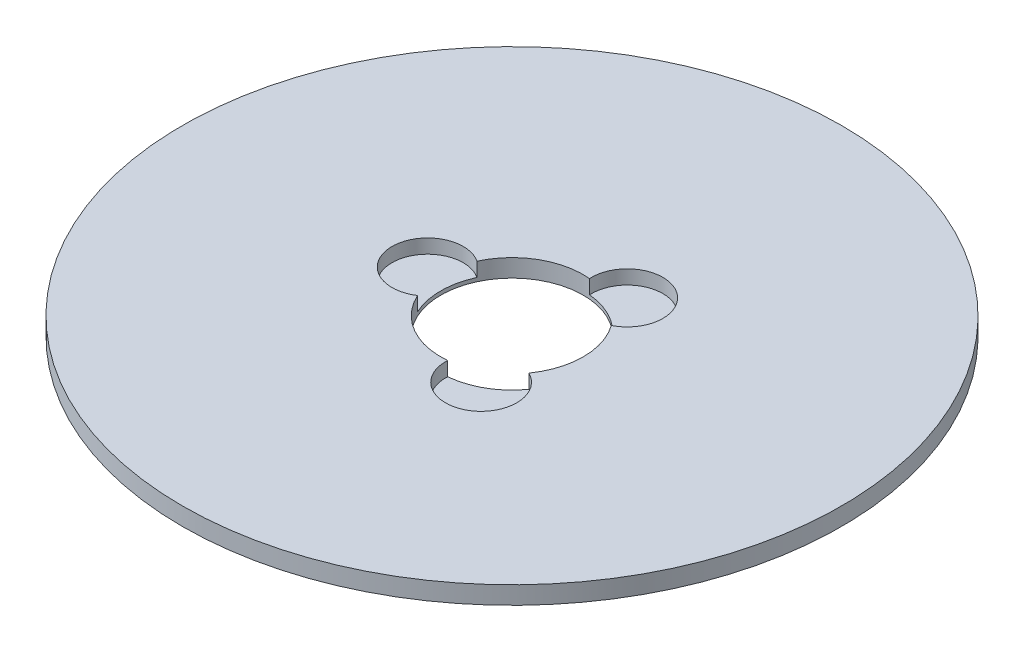
ISO-10303-21;
HEADER;
FILE_DESCRIPTION(('STEP AP214'),'2;1');
FILE_NAME('part.step','',(''),(''),'','','');
FILE_SCHEMA(('AUTOMOTIVE_DESIGN { 1 0 10303 214 1 1 1 1 }'));
ENDSEC;
DATA;
#1=APPLICATION_CONTEXT('core data for automotive mechanical design processes');
#2=APPLICATION_PROTOCOL_DEFINITION('international standard','automotive_design',2000,#1);
#3=PRODUCT_CONTEXT('',#1,'mechanical');
#4=PRODUCT('Part','Part','',(#3));
#5=PRODUCT_RELATED_PRODUCT_CATEGORY('part','',(#4));
#6=PRODUCT_DEFINITION_FORMATION('','',#4);
#7=PRODUCT_DEFINITION_CONTEXT('part definition',#1,'design');
#8=PRODUCT_DEFINITION('design','',#6,#7);
#9=PRODUCT_DEFINITION_SHAPE('','',#8);
#10=(LENGTH_UNIT() NAMED_UNIT(*) SI_UNIT(.MILLI.,.METRE.));
#11=(NAMED_UNIT(*) PLANE_ANGLE_UNIT() SI_UNIT($,.RADIAN.));
#12=(NAMED_UNIT(*) SI_UNIT($,.STERADIAN.) SOLID_ANGLE_UNIT());
#13=UNCERTAINTY_MEASURE_WITH_UNIT(LENGTH_MEASURE(1.E-05),#10,'distance_accuracy_value','');
#14=(GEOMETRIC_REPRESENTATION_CONTEXT(3) GLOBAL_UNCERTAINTY_ASSIGNED_CONTEXT((#13)) GLOBAL_UNIT_ASSIGNED_CONTEXT((#10,
#11,#12)) REPRESENTATION_CONTEXT('',''));
#15=CARTESIAN_POINT('',(0.,0.,0.));
#16=DIRECTION('',(0.,0.,1.));
#17=DIRECTION('',(1.,0.,0.));
#18=AXIS2_PLACEMENT_3D('',#15,#16,#17);
#19=CARTESIAN_POINT('',(0.,5.,0.));
#20=DIRECTION('',(0.,-1.,0.));
#21=DIRECTION('',(0.,0.,-1.));
#22=AXIS2_PLACEMENT_3D('',#19,#20,#21);
#23=CYLINDRICAL_SURFACE('',#22,92.5);
#24=CARTESIAN_POINT('',(0.,5.,0.));
#25=DIRECTION('',(0.,1.,0.));
#26=DIRECTION('',(0.,0.,1.));
#27=AXIS2_PLACEMENT_3D('',#24,#25,#26);
#28=CIRCLE('',#27,92.5);
#29=CARTESIAN_POINT('',(0.,5.,92.5));
#30=VERTEX_POINT('',#29);
#31=EDGE_CURVE('E126',#30,#30,#28,.T.);
#32=ORIENTED_EDGE('',*,*,#31,.F.);
#33=EDGE_LOOP('',(#32));
#34=FACE_BOUND('',#33,.T.);
#35=CARTESIAN_POINT('',(0.,0.,0.));
#36=DIRECTION('',(0.,1.,0.));
#37=DIRECTION('',(0.,0.,1.));
#38=AXIS2_PLACEMENT_3D('',#35,#36,#37);
#39=CIRCLE('',#38,92.5);
#40=CARTESIAN_POINT('',(0.,0.,92.5));
#41=VERTEX_POINT('',#40);
#42=EDGE_CURVE('E124',#41,#41,#39,.T.);
#43=ORIENTED_EDGE('',*,*,#42,.T.);
#44=EDGE_LOOP('',(#43));
#45=FACE_BOUND('',#44,.T.);
#46=ADVANCED_FACE('F39',(#34,#45),#23,.T.);
#47=CARTESIAN_POINT('',(0.,5.,0.));
#48=DIRECTION('',(0.,1.,0.));
#49=DIRECTION('',(0.,0.,1.));
#50=AXIS2_PLACEMENT_3D('',#47,#48,#49);
#51=PLANE('',#50);
#52=CARTESIAN_POINT('',(11.841012717747,5.,20.5092356402068));
#53=DIRECTION('',(0.,1.,0.));
#54=DIRECTION('',(0.866025403784436,0.,-0.500000000000004));
#55=AXIS2_PLACEMENT_3D('',#52,#53,#54);
#56=CIRCLE('',#55,10.);
#57=CARTESIAN_POINT('',(1.85877733722325,5.,19.9134363385787));
#58=VERTEX_POINT('',#57);
#59=CARTESIAN_POINT('',(16.3161530772418,5.,11.5664665633033));
#60=VERTEX_POINT('',#59);
#61=EDGE_CURVE('E147',#58,#60,#56,.T.);
#62=ORIENTED_EDGE('',*,*,#61,.F.);
#63=CARTESIAN_POINT('',(0.,5.,0.));
#64=DIRECTION('',(0.,1.,0.));
#65=DIRECTION('',(0.,0.,1.));
#66=AXIS2_PLACEMENT_3D('',#63,#64,#65);
#67=CIRCLE('',#66,20.);
#68=CARTESIAN_POINT('',(-18.1749304144649,5.,8.34696977527529));
#69=VERTEX_POINT('',#68);
#70=EDGE_CURVE('E118',#69,#58,#67,.T.);
#71=ORIENTED_EDGE('',*,*,#70,.F.);
#72=CARTESIAN_POINT('',(-23.6820254354937,5.,0.));
#73=DIRECTION('',(0.,1.,0.));
#74=DIRECTION('',(0.,0.,1.));
#75=AXIS2_PLACEMENT_3D('',#72,#73,#74);
#76=CIRCLE('',#75,10.);
#77=CARTESIAN_POINT('',(-18.1749304144649,5.,-8.34696977527529));
#78=VERTEX_POINT('',#77);
#79=EDGE_CURVE('E113',#78,#69,#76,.T.);
#80=ORIENTED_EDGE('',*,*,#79,.F.);
#81=CARTESIAN_POINT('',(1.85877733722297,5.,-19.9134363385787));
#82=VERTEX_POINT('',#81);
#83=EDGE_CURVE('E106',#82,#78,#67,.T.);
#84=ORIENTED_EDGE('',*,*,#83,.F.);
#85=CARTESIAN_POINT('',(11.8410127177467,5.,-20.5092356402069));
#86=DIRECTION('',(0.,1.,0.));
#87=DIRECTION('',(-0.866025403784443,0.,-0.499999999999992));
#88=AXIS2_PLACEMENT_3D('',#85,#86,#87);
#89=CIRCLE('',#88,10.);
#90=CARTESIAN_POINT('',(16.3161530772416,5.,-11.5664665633035));
#91=VERTEX_POINT('',#90);
#92=EDGE_CURVE('E90',#91,#82,#89,.T.);
#93=ORIENTED_EDGE('',*,*,#92,.F.);
#94=EDGE_CURVE('E116',#60,#91,#67,.T.);
#95=ORIENTED_EDGE('',*,*,#94,.F.);
#96=EDGE_LOOP('',(#62,#71,#80,#84,#93,#95));
#97=FACE_BOUND('',#96,.T.);
#98=ORIENTED_EDGE('',*,*,#31,.T.);
#99=EDGE_LOOP('',(#98));
#100=FACE_BOUND('',#99,.T.);
#101=ADVANCED_FACE('F115',(#97,#100),#51,.T.);
#102=CARTESIAN_POINT('',(0.,0.,0.));
#103=DIRECTION('',(0.,1.,0.));
#104=DIRECTION('',(0.,0.,1.));
#105=AXIS2_PLACEMENT_3D('',#102,#103,#104);
#106=PLANE('',#105);
#107=CARTESIAN_POINT('',(0.,0.,0.));
#108=DIRECTION('',(0.,1.,0.));
#109=DIRECTION('',(0.,0.,1.));
#110=AXIS2_PLACEMENT_3D('',#107,#108,#109);
#111=CIRCLE('',#110,20.);
#112=CARTESIAN_POINT('',(0.,0.,20.));
#113=VERTEX_POINT('',#112);
#114=EDGE_CURVE('E120',#113,#113,#111,.T.);
#115=ORIENTED_EDGE('',*,*,#114,.T.);
#116=EDGE_LOOP('',(#115));
#117=FACE_BOUND('',#116,.T.);
#118=ORIENTED_EDGE('',*,*,#42,.F.);
#119=EDGE_LOOP('',(#118));
#120=FACE_BOUND('',#119,.T.);
#121=ADVANCED_FACE('F164',(#117,#120),#106,.F.);
#122=CARTESIAN_POINT('',(0.,5.,0.));
#123=DIRECTION('',(0.,-1.,0.));
#124=DIRECTION('',(0.,0.,-1.));
#125=AXIS2_PLACEMENT_3D('',#122,#123,#124);
#126=CYLINDRICAL_SURFACE('',#125,20.);
#127=DIRECTION('',(0.,1.,0.));
#128=VECTOR('',#127,1.);
#129=CARTESIAN_POINT('',(1.85877733722325,3.02460001668179,19.9134363385787));
#130=LINE('',#129,#128);
#131=CARTESIAN_POINT('',(1.85877733722325,1.04920003336359,19.9134363385787));
#132=VERTEX_POINT('',#131);
#133=EDGE_CURVE('E11',#132,#58,#130,.T.);
#134=ORIENTED_EDGE('',*,*,#133,.F.);
#135=CARTESIAN_POINT('',(0.,1.04920003336359,0.));
#136=DIRECTION('',(0.,1.,0.));
#137=DIRECTION('',(0.,0.,1.));
#138=AXIS2_PLACEMENT_3D('',#135,#136,#137);
#139=CIRCLE('',#138,20.);
#140=CARTESIAN_POINT('',(16.3161530772418,1.04920003336359,11.5664665633033));
#141=VERTEX_POINT('',#140);
#142=EDGE_CURVE('E144',#132,#141,#139,.T.);
#143=ORIENTED_EDGE('',*,*,#142,.T.);
#144=DIRECTION('',(0.,1.,0.));
#145=VECTOR('',#144,1.);
#146=CARTESIAN_POINT('',(16.3161530772418,3.02460001668179,11.5664665633033));
#147=LINE('',#146,#145);
#148=EDGE_CURVE('E46',#60,#141,#147,.F.);
#149=ORIENTED_EDGE('',*,*,#148,.F.);
#150=ORIENTED_EDGE('',*,*,#94,.T.);
#151=DIRECTION('',(0.,1.,0.));
#152=VECTOR('',#151,1.);
#153=CARTESIAN_POINT('',(16.3161530772416,3.02460001668179,-11.5664665633035));
#154=LINE('',#153,#152);
#155=CARTESIAN_POINT('',(16.3161530772416,1.04920003336359,-11.5664665633035));
#156=VERTEX_POINT('',#155);
#157=EDGE_CURVE('E92',#156,#91,#154,.T.);
#158=ORIENTED_EDGE('',*,*,#157,.F.);
#159=CARTESIAN_POINT('',(0.,1.04920003336359,0.));
#160=DIRECTION('',(0.,1.,0.));
#161=DIRECTION('',(0.,0.,1.));
#162=AXIS2_PLACEMENT_3D('',#159,#160,#161);
#163=CIRCLE('',#162,20.);
#164=CARTESIAN_POINT('',(1.85877733722297,1.04920003336359,-19.9134363385787));
#165=VERTEX_POINT('',#164);
#166=EDGE_CURVE('E107',#156,#165,#163,.T.);
#167=ORIENTED_EDGE('',*,*,#166,.T.);
#168=DIRECTION('',(0.,1.,0.));
#169=VECTOR('',#168,1.);
#170=CARTESIAN_POINT('',(1.85877733722297,3.02460001668179,-19.9134363385787));
#171=LINE('',#170,#169);
#172=EDGE_CURVE('E95',#82,#165,#171,.F.);
#173=ORIENTED_EDGE('',*,*,#172,.F.);
#174=ORIENTED_EDGE('',*,*,#83,.T.);
#175=DIRECTION('',(0.,1.,0.));
#176=VECTOR('',#175,1.);
#177=CARTESIAN_POINT('',(-18.1749304144649,3.02460001668179,-8.34696977527529));
#178=LINE('',#177,#176);
#179=CARTESIAN_POINT('',(-18.1749304144649,1.04920003336359,-8.34696977527529));
#180=VERTEX_POINT('',#179);
#181=EDGE_CURVE('E143',#180,#78,#178,.T.);
#182=ORIENTED_EDGE('',*,*,#181,.F.);
#183=CARTESIAN_POINT('',(0.,1.04920003336359,0.));
#184=DIRECTION('',(0.,1.,0.));
#185=DIRECTION('',(0.,0.,1.));
#186=AXIS2_PLACEMENT_3D('',#183,#184,#185);
#187=CIRCLE('',#186,20.);
#188=CARTESIAN_POINT('',(-18.1749304144649,1.04920003336359,8.34696977527529));
#189=VERTEX_POINT('',#188);
#190=EDGE_CURVE('E132',#180,#189,#187,.T.);
#191=ORIENTED_EDGE('',*,*,#190,.T.);
#192=DIRECTION('',(0.,1.,0.));
#193=VECTOR('',#192,1.);
#194=CARTESIAN_POINT('',(-18.1749304144649,3.02460001668179,8.34696977527529));
#195=LINE('',#194,#193);
#196=EDGE_CURVE('E137',#69,#189,#195,.F.);
#197=ORIENTED_EDGE('',*,*,#196,.F.);
#198=ORIENTED_EDGE('',*,*,#70,.T.);
#199=EDGE_LOOP('',(#134,#143,#149,#150,#158,#167,#173,#174,#182,#191,#197,#198));
#200=FACE_BOUND('',#199,.T.);
#201=ORIENTED_EDGE('',*,*,#114,.F.);
#202=EDGE_LOOP('',(#201));
#203=FACE_BOUND('',#202,.T.);
#204=ADVANCED_FACE('F103',(#200,#203),#126,.F.);
#205=CARTESIAN_POINT('',(-23.6820254354937,1.04920003336359,0.));
#206=DIRECTION('',(0.,1.,0.));
#207=DIRECTION('',(0.,0.,1.));
#208=AXIS2_PLACEMENT_3D('',#205,#206,#207);
#209=CYLINDRICAL_SURFACE('',#208,10.);
#210=ORIENTED_EDGE('',*,*,#181,.T.);
#211=ORIENTED_EDGE('',*,*,#79,.T.);
#212=ORIENTED_EDGE('',*,*,#196,.T.);
#213=CARTESIAN_POINT('',(-23.6820254354937,1.04920003336359,0.));
#214=DIRECTION('',(0.,1.,0.));
#215=DIRECTION('',(0.,0.,1.));
#216=AXIS2_PLACEMENT_3D('',#213,#214,#215);
#217=CIRCLE('',#216,10.);
#218=EDGE_CURVE('E121',#180,#189,#217,.T.);
#219=ORIENTED_EDGE('',*,*,#218,.F.);
#220=EDGE_LOOP('',(#210,#211,#212,#219));
#221=FACE_BOUND('',#220,.T.);
#222=ADVANCED_FACE('F174',(#221),#209,.F.);
#223=CARTESIAN_POINT('',(-23.6820254354937,1.04920003336359,0.));
#224=DIRECTION('',(0.,1.,0.));
#225=DIRECTION('',(0.,0.,1.));
#226=AXIS2_PLACEMENT_3D('',#223,#224,#225);
#227=PLANE('',#226);
#228=ORIENTED_EDGE('',*,*,#218,.T.);
#229=ORIENTED_EDGE('',*,*,#190,.F.);
#230=EDGE_LOOP('',(#228,#229));
#231=FACE_BOUND('',#230,.T.);
#232=ADVANCED_FACE('F177',(#231),#227,.T.);
#233=CARTESIAN_POINT('',(11.8410127177467,1.04920003336359,-20.5092356402069));
#234=DIRECTION('',(0.,1.,0.));
#235=DIRECTION('',(0.,0.,1.));
#236=AXIS2_PLACEMENT_3D('',#233,#234,#235);
#237=CYLINDRICAL_SURFACE('',#236,10.);
#238=ORIENTED_EDGE('',*,*,#157,.T.);
#239=ORIENTED_EDGE('',*,*,#92,.T.);
#240=ORIENTED_EDGE('',*,*,#172,.T.);
#241=CARTESIAN_POINT('',(11.8410127177467,1.04920003336359,-20.5092356402069));
#242=DIRECTION('',(0.,1.,0.));
#243=DIRECTION('',(-0.866025403784443,0.,-0.499999999999992));
#244=AXIS2_PLACEMENT_3D('',#241,#242,#243);
#245=CIRCLE('',#244,10.);
#246=EDGE_CURVE('E56',#156,#165,#245,.T.);
#247=ORIENTED_EDGE('',*,*,#246,.F.);
#248=EDGE_LOOP('',(#238,#239,#240,#247));
#249=FACE_BOUND('',#248,.T.);
#250=ADVANCED_FACE('F93',(#249),#237,.F.);
#251=CARTESIAN_POINT('',(11.8410127177467,1.04920003336359,-20.5092356402069));
#252=DIRECTION('',(0.,1.,0.));
#253=DIRECTION('',(-0.866025403784443,0.,-0.499999999999992));
#254=AXIS2_PLACEMENT_3D('',#251,#252,#253);
#255=PLANE('',#254);
#256=ORIENTED_EDGE('',*,*,#246,.T.);
#257=ORIENTED_EDGE('',*,*,#166,.F.);
#258=EDGE_LOOP('',(#256,#257));
#259=FACE_BOUND('',#258,.T.);
#260=ADVANCED_FACE('F160',(#259),#255,.T.);
#261=CARTESIAN_POINT('',(11.841012717747,1.04920003336359,20.5092356402068));
#262=DIRECTION('',(0.,1.,0.));
#263=DIRECTION('',(0.,0.,1.));
#264=AXIS2_PLACEMENT_3D('',#261,#262,#263);
#265=CYLINDRICAL_SURFACE('',#264,10.);
#266=ORIENTED_EDGE('',*,*,#133,.T.);
#267=ORIENTED_EDGE('',*,*,#61,.T.);
#268=ORIENTED_EDGE('',*,*,#148,.T.);
#269=CARTESIAN_POINT('',(11.841012717747,1.04920003336359,20.5092356402068));
#270=DIRECTION('',(0.,1.,0.));
#271=DIRECTION('',(0.866025403784436,0.,-0.500000000000004));
#272=AXIS2_PLACEMENT_3D('',#269,#270,#271);
#273=CIRCLE('',#272,10.);
#274=EDGE_CURVE('E55',#132,#141,#273,.T.);
#275=ORIENTED_EDGE('',*,*,#274,.F.);
#276=EDGE_LOOP('',(#266,#267,#268,#275));
#277=FACE_BOUND('',#276,.T.);
#278=ADVANCED_FACE('F149',(#277),#265,.F.);
#279=CARTESIAN_POINT('',(11.841012717747,1.04920003336359,20.5092356402068));
#280=DIRECTION('',(0.,1.,0.));
#281=DIRECTION('',(0.866025403784436,0.,-0.500000000000004));
#282=AXIS2_PLACEMENT_3D('',#279,#280,#281);
#283=PLANE('',#282);
#284=ORIENTED_EDGE('',*,*,#274,.T.);
#285=ORIENTED_EDGE('',*,*,#142,.F.);
#286=EDGE_LOOP('',(#284,#285));
#287=FACE_BOUND('',#286,.T.);
#288=ADVANCED_FACE('F151',(#287),#283,.T.);
#289=CLOSED_SHELL('',(#46,#101,#121,#204,#222,#232,#250,#260,#278,#288));
#290=MANIFOLD_SOLID_BREP('B2',#289);
#291=ADVANCED_BREP_SHAPE_REPRESENTATION('',(#18,#290),#14);
#292=SHAPE_DEFINITION_REPRESENTATION(#9,#291);
ENDSEC;
END-ISO-10303-21;
